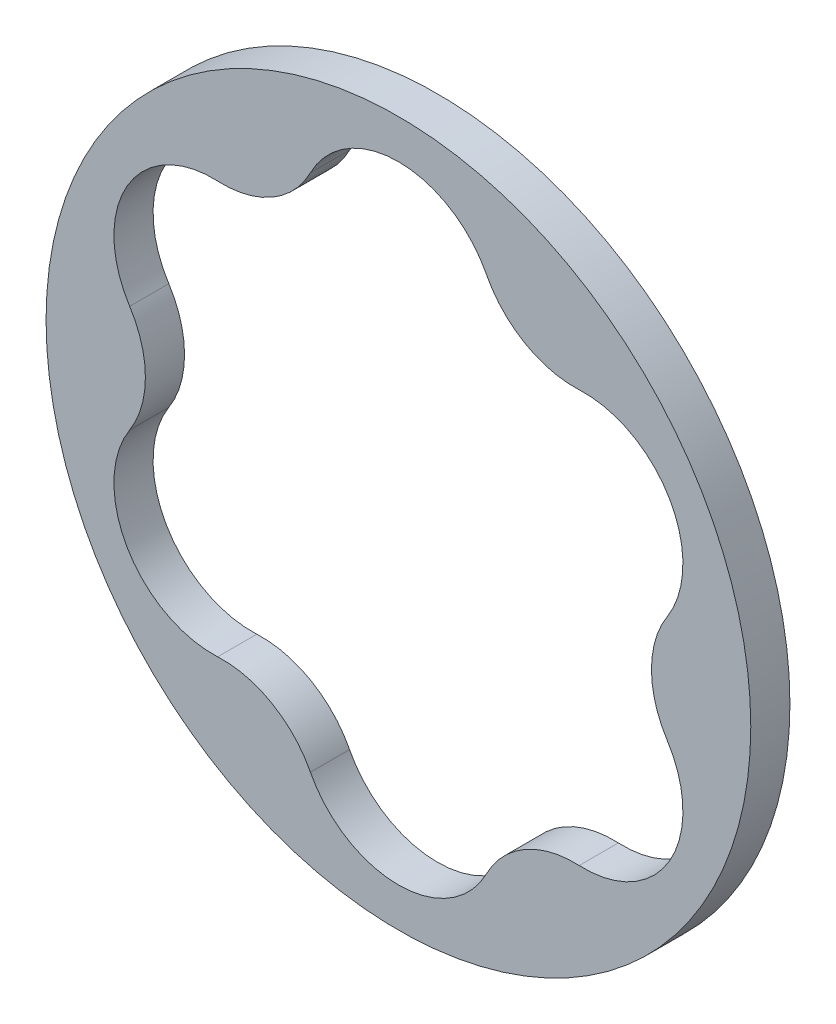
ISO-10303-21;
HEADER;
FILE_DESCRIPTION(('STEP AP214'),'2;1');
FILE_NAME('part.step','',(''),(''),'','','');
FILE_SCHEMA(('AUTOMOTIVE_DESIGN { 1 0 10303 214 1 1 1 1 }'));
ENDSEC;
DATA;
#1=APPLICATION_CONTEXT('core data for automotive mechanical design processes');
#2=APPLICATION_PROTOCOL_DEFINITION('international standard','automotive_design',2000,#1);
#3=PRODUCT_CONTEXT('',#1,'mechanical');
#4=PRODUCT('Part','Part','',(#3));
#5=PRODUCT_RELATED_PRODUCT_CATEGORY('part','',(#4));
#6=PRODUCT_DEFINITION_FORMATION('','',#4);
#7=PRODUCT_DEFINITION_CONTEXT('part definition',#1,'design');
#8=PRODUCT_DEFINITION('design','',#6,#7);
#9=PRODUCT_DEFINITION_SHAPE('','',#8);
#10=(LENGTH_UNIT() NAMED_UNIT(*) SI_UNIT(.MILLI.,.METRE.));
#11=(NAMED_UNIT(*) PLANE_ANGLE_UNIT() SI_UNIT($,.RADIAN.));
#12=(NAMED_UNIT(*) SI_UNIT($,.STERADIAN.) SOLID_ANGLE_UNIT());
#13=UNCERTAINTY_MEASURE_WITH_UNIT(LENGTH_MEASURE(1.E-05),#10,'distance_accuracy_value','');
#14=(GEOMETRIC_REPRESENTATION_CONTEXT(3) GLOBAL_UNCERTAINTY_ASSIGNED_CONTEXT((#13)) GLOBAL_UNIT_ASSIGNED_CONTEXT((#10,
#11,#12)) REPRESENTATION_CONTEXT('',''));
#15=CARTESIAN_POINT('',(0.,0.,0.));
#16=DIRECTION('',(0.,0.,1.));
#17=DIRECTION('',(1.,0.,0.));
#18=AXIS2_PLACEMENT_3D('',#15,#16,#17);
#19=CARTESIAN_POINT('',(0.,0.,0.79375));
#20=DIRECTION('',(0.,0.,1.));
#21=DIRECTION('',(1.,0.,0.));
#22=AXIS2_PLACEMENT_3D('',#19,#20,#21);
#23=PLANE('',#22);
#24=CARTESIAN_POINT('',(0.,0.,0.79375));
#25=DIRECTION('',(0.,0.,1.));
#26=DIRECTION('',(1.,0.,0.));
#27=AXIS2_PLACEMENT_3D('',#24,#25,#26);
#28=CIRCLE('',#27,14.2875);
#29=CARTESIAN_POINT('',(14.2875,0.,0.79375));
#30=VERTEX_POINT('',#29);
#31=EDGE_CURVE('E11',#30,#30,#28,.T.);
#32=ORIENTED_EDGE('',*,*,#31,.T.);
#33=EDGE_LOOP('',(#32));
#34=FACE_BOUND('',#33,.T.);
#35=CARTESIAN_POINT('',(7.52217892727267,4.3429320285534,0.79375));
#36=DIRECTION('',(0.,0.,-1.));
#37=DIRECTION('',(-1.,0.,0.));
#38=AXIS2_PLACEMENT_3D('',#35,#36,#37);
#39=CIRCLE('',#38,4.0141359428932);
#40=CARTESIAN_POINT('',(7.32968208553851,8.35244974692671,0.79375));
#41=VERTEX_POINT('',#40);
#42=CARTESIAN_POINT('',(10.8982747074407,2.1714660142767,0.79375));
#43=VERTEX_POINT('',#42);
#44=EDGE_CURVE('E129',#41,#43,#39,.T.);
#45=ORIENTED_EDGE('',*,*,#44,.T.);
#46=CARTESIAN_POINT('',(14.2743704876087,0.,0.79375));
#47=DIRECTION('',(0.,0.,1.));
#48=DIRECTION('',(-1.,0.,0.));
#49=AXIS2_PLACEMENT_3D('',#46,#47,#48);
#50=CIRCLE('',#49,4.0141359428932);
#51=CARTESIAN_POINT('',(10.8982747074407,-2.1714660142767,0.79375));
#52=VERTEX_POINT('',#51);
#53=EDGE_CURVE('E138',#43,#52,#50,.T.);
#54=ORIENTED_EDGE('',*,*,#53,.T.);
#55=CARTESIAN_POINT('',(7.52217892727267,-4.34293202855341,0.79375));
#56=DIRECTION('',(0.,0.,-1.));
#57=DIRECTION('',(-1.,0.,0.));
#58=AXIS2_PLACEMENT_3D('',#55,#56,#57);
#59=CIRCLE('',#58,4.0141359428932);
#60=CARTESIAN_POINT('',(7.32968208553852,-8.35244974692671,0.79375));
#61=VERTEX_POINT('',#60);
#62=EDGE_CURVE('E53',#52,#61,#59,.T.);
#63=ORIENTED_EDGE('',*,*,#62,.T.);
#64=CARTESIAN_POINT('',(7.13718524380436,-12.3619674653,0.79375));
#65=DIRECTION('',(0.,0.,1.));
#66=DIRECTION('',(-1.,0.,0.));
#67=AXIS2_PLACEMENT_3D('',#64,#65,#66);
#68=CIRCLE('',#67,4.0141359428932);
#69=CARTESIAN_POINT('',(3.56859262190219,-10.5239157612034,0.79375));
#70=VERTEX_POINT('',#69);
#71=EDGE_CURVE('E151',#61,#70,#68,.T.);
#72=ORIENTED_EDGE('',*,*,#71,.T.);
#73=CARTESIAN_POINT('',(0.,-8.6858640571068,0.79375));
#74=DIRECTION('',(0.,0.,-1.));
#75=DIRECTION('',(-1.,0.,0.));
#76=AXIS2_PLACEMENT_3D('',#73,#74,#75);
#77=CIRCLE('',#76,4.0141359428932);
#78=CARTESIAN_POINT('',(-3.56859262190217,-10.5239157612034,0.79375));
#79=VERTEX_POINT('',#78);
#80=EDGE_CURVE('E154',#70,#79,#77,.T.);
#81=ORIENTED_EDGE('',*,*,#80,.T.);
#82=CARTESIAN_POINT('',(-7.13718524380435,-12.3619674653,0.79375));
#83=DIRECTION('',(0.,0.,1.));
#84=DIRECTION('',(-1.,0.,0.));
#85=AXIS2_PLACEMENT_3D('',#82,#83,#84);
#86=CIRCLE('',#85,4.0141359428932);
#87=CARTESIAN_POINT('',(-7.3296820855385,-8.3524497469267,0.79375));
#88=VERTEX_POINT('',#87);
#89=EDGE_CURVE('E157',#79,#88,#86,.T.);
#90=ORIENTED_EDGE('',*,*,#89,.T.);
#91=CARTESIAN_POINT('',(-7.52217892727265,-4.3429320285534,0.79375));
#92=DIRECTION('',(0.,0.,-1.));
#93=DIRECTION('',(-1.,0.,0.));
#94=AXIS2_PLACEMENT_3D('',#91,#92,#93);
#95=CIRCLE('',#94,4.0141359428932);
#96=CARTESIAN_POINT('',(-10.8982747074407,-2.1714660142767,0.79375));
#97=VERTEX_POINT('',#96);
#98=EDGE_CURVE('E160',#88,#97,#95,.T.);
#99=ORIENTED_EDGE('',*,*,#98,.T.);
#100=CARTESIAN_POINT('',(-14.2743704876087,0.,0.79375));
#101=DIRECTION('',(0.,0.,1.));
#102=DIRECTION('',(-1.,0.,0.));
#103=AXIS2_PLACEMENT_3D('',#100,#101,#102);
#104=CIRCLE('',#103,4.0141359428932);
#105=CARTESIAN_POINT('',(-10.8982747074407,2.1714660142767,0.79375));
#106=VERTEX_POINT('',#105);
#107=EDGE_CURVE('E163',#97,#106,#104,.T.);
#108=ORIENTED_EDGE('',*,*,#107,.T.);
#109=CARTESIAN_POINT('',(-7.52217892727264,4.34293202855339,0.79375));
#110=DIRECTION('',(0.,0.,-1.));
#111=DIRECTION('',(-1.,0.,0.));
#112=AXIS2_PLACEMENT_3D('',#109,#110,#111);
#113=CIRCLE('',#112,4.0141359428932);
#114=CARTESIAN_POINT('',(-7.32968208553849,8.35244974692669,0.79375));
#115=VERTEX_POINT('',#114);
#116=EDGE_CURVE('E166',#106,#115,#113,.T.);
#117=ORIENTED_EDGE('',*,*,#116,.T.);
#118=CARTESIAN_POINT('',(-7.13718524380434,12.3619674653,0.79375));
#119=DIRECTION('',(0.,0.,1.));
#120=DIRECTION('',(-1.,0.,0.));
#121=AXIS2_PLACEMENT_3D('',#118,#119,#120);
#122=CIRCLE('',#121,4.0141359428932);
#123=CARTESIAN_POINT('',(-3.56859262190216,10.5239157612034,0.79375));
#124=VERTEX_POINT('',#123);
#125=EDGE_CURVE('E169',#115,#124,#122,.T.);
#126=ORIENTED_EDGE('',*,*,#125,.T.);
#127=CARTESIAN_POINT('',(0.,8.68586405710679,0.79375));
#128=DIRECTION('',(0.,0.,-1.));
#129=DIRECTION('',(-1.,0.,0.));
#130=AXIS2_PLACEMENT_3D('',#127,#128,#129);
#131=CIRCLE('',#130,4.01413594289319);
#132=CARTESIAN_POINT('',(3.56859262190217,10.5239157612034,0.79375));
#133=VERTEX_POINT('',#132);
#134=EDGE_CURVE('E172',#124,#133,#131,.T.);
#135=ORIENTED_EDGE('',*,*,#134,.T.);
#136=CARTESIAN_POINT('',(7.13718524380434,12.3619674653,0.79375));
#137=DIRECTION('',(0.,0.,1.));
#138=DIRECTION('',(-1.,0.,0.));
#139=AXIS2_PLACEMENT_3D('',#136,#137,#138);
#140=CIRCLE('',#139,4.0141359428932);
#141=EDGE_CURVE('E135',#133,#41,#140,.T.);
#142=ORIENTED_EDGE('',*,*,#141,.T.);
#143=EDGE_LOOP('',(#45,#54,#63,#72,#81,#90,#99,#108,#117,#126,#135,#142));
#144=FACE_BOUND('',#143,.T.);
#145=ADVANCED_FACE('F38',(#34,#144),#23,.T.);
#146=CARTESIAN_POINT('',(0.,0.,-0.79375));
#147=DIRECTION('',(0.,0.,1.));
#148=DIRECTION('',(1.,0.,0.));
#149=AXIS2_PLACEMENT_3D('',#146,#147,#148);
#150=PLANE('',#149);
#151=CARTESIAN_POINT('',(0.,0.,-0.79375));
#152=DIRECTION('',(0.,0.,1.));
#153=DIRECTION('',(1.,0.,0.));
#154=AXIS2_PLACEMENT_3D('',#151,#152,#153);
#155=CIRCLE('',#154,14.2875);
#156=CARTESIAN_POINT('',(14.2875,0.,-0.79375));
#157=VERTEX_POINT('',#156);
#158=EDGE_CURVE('E42',#157,#157,#155,.T.);
#159=ORIENTED_EDGE('',*,*,#158,.F.);
#160=EDGE_LOOP('',(#159));
#161=FACE_BOUND('',#160,.T.);
#162=CARTESIAN_POINT('',(14.2743704876087,0.,-0.79375));
#163=DIRECTION('',(0.,0.,1.));
#164=DIRECTION('',(-1.,0.,0.));
#165=AXIS2_PLACEMENT_3D('',#162,#163,#164);
#166=CIRCLE('',#165,4.0141359428932);
#167=CARTESIAN_POINT('',(10.8982747074407,2.1714660142767,-0.79375));
#168=VERTEX_POINT('',#167);
#169=CARTESIAN_POINT('',(10.8982747074407,-2.17146601427671,-0.79375));
#170=VERTEX_POINT('',#169);
#171=EDGE_CURVE('E176',#168,#170,#166,.T.);
#172=ORIENTED_EDGE('',*,*,#171,.F.);
#173=CARTESIAN_POINT('',(7.52217892727267,4.3429320285534,-0.79375));
#174=DIRECTION('',(0.,0.,-1.));
#175=DIRECTION('',(-1.,0.,0.));
#176=AXIS2_PLACEMENT_3D('',#173,#174,#175);
#177=CIRCLE('',#176,4.0141359428932);
#178=CARTESIAN_POINT('',(7.32968208553851,8.35244974692671,-0.79375));
#179=VERTEX_POINT('',#178);
#180=EDGE_CURVE('E61',#179,#168,#177,.T.);
#181=ORIENTED_EDGE('',*,*,#180,.F.);
#182=CARTESIAN_POINT('',(7.13718524380434,12.3619674653,-0.79375));
#183=DIRECTION('',(0.,0.,1.));
#184=DIRECTION('',(-1.,0.,0.));
#185=AXIS2_PLACEMENT_3D('',#182,#183,#184);
#186=CIRCLE('',#185,4.0141359428932);
#187=CARTESIAN_POINT('',(3.56859262190217,10.5239157612034,-0.79375));
#188=VERTEX_POINT('',#187);
#189=EDGE_CURVE('E144',#188,#179,#186,.T.);
#190=ORIENTED_EDGE('',*,*,#189,.F.);
#191=CARTESIAN_POINT('',(0.,8.68586405710679,-0.79375));
#192=DIRECTION('',(0.,0.,-1.));
#193=DIRECTION('',(-1.,0.,0.));
#194=AXIS2_PLACEMENT_3D('',#191,#192,#193);
#195=CIRCLE('',#194,4.01413594289319);
#196=CARTESIAN_POINT('',(-3.56859262190216,10.5239157612034,-0.79375));
#197=VERTEX_POINT('',#196);
#198=EDGE_CURVE('E147',#197,#188,#195,.T.);
#199=ORIENTED_EDGE('',*,*,#198,.F.);
#200=CARTESIAN_POINT('',(-7.13718524380434,12.3619674653,-0.79375));
#201=DIRECTION('',(0.,0.,1.));
#202=DIRECTION('',(-1.,0.,0.));
#203=AXIS2_PLACEMENT_3D('',#200,#201,#202);
#204=CIRCLE('',#203,4.0141359428932);
#205=CARTESIAN_POINT('',(-7.32968208553849,8.35244974692669,-0.79375));
#206=VERTEX_POINT('',#205);
#207=EDGE_CURVE('E199',#206,#197,#204,.T.);
#208=ORIENTED_EDGE('',*,*,#207,.F.);
#209=CARTESIAN_POINT('',(-7.52217892727264,4.34293202855339,-0.79375));
#210=DIRECTION('',(0.,0.,-1.));
#211=DIRECTION('',(-1.,0.,0.));
#212=AXIS2_PLACEMENT_3D('',#209,#210,#211);
#213=CIRCLE('',#212,4.0141359428932);
#214=CARTESIAN_POINT('',(-10.8982747074407,2.1714660142767,-0.79375));
#215=VERTEX_POINT('',#214);
#216=EDGE_CURVE('E196',#215,#206,#213,.T.);
#217=ORIENTED_EDGE('',*,*,#216,.F.);
#218=CARTESIAN_POINT('',(-14.2743704876087,0.,-0.79375));
#219=DIRECTION('',(0.,0.,1.));
#220=DIRECTION('',(-1.,0.,0.));
#221=AXIS2_PLACEMENT_3D('',#218,#219,#220);
#222=CIRCLE('',#221,4.0141359428932);
#223=CARTESIAN_POINT('',(-10.8982747074407,-2.1714660142767,-0.79375));
#224=VERTEX_POINT('',#223);
#225=EDGE_CURVE('E193',#224,#215,#222,.T.);
#226=ORIENTED_EDGE('',*,*,#225,.F.);
#227=CARTESIAN_POINT('',(-7.52217892727265,-4.3429320285534,-0.79375));
#228=DIRECTION('',(0.,0.,-1.));
#229=DIRECTION('',(-1.,0.,0.));
#230=AXIS2_PLACEMENT_3D('',#227,#228,#229);
#231=CIRCLE('',#230,4.0141359428932);
#232=CARTESIAN_POINT('',(-7.3296820855385,-8.3524497469267,-0.79375));
#233=VERTEX_POINT('',#232);
#234=EDGE_CURVE('E190',#233,#224,#231,.T.);
#235=ORIENTED_EDGE('',*,*,#234,.F.);
#236=CARTESIAN_POINT('',(-7.13718524380435,-12.3619674653,-0.79375));
#237=DIRECTION('',(0.,0.,1.));
#238=DIRECTION('',(-1.,0.,0.));
#239=AXIS2_PLACEMENT_3D('',#236,#237,#238);
#240=CIRCLE('',#239,4.0141359428932);
#241=CARTESIAN_POINT('',(-3.56859262190217,-10.5239157612034,-0.79375));
#242=VERTEX_POINT('',#241);
#243=EDGE_CURVE('E187',#242,#233,#240,.T.);
#244=ORIENTED_EDGE('',*,*,#243,.F.);
#245=CARTESIAN_POINT('',(0.,-8.6858640571068,-0.79375));
#246=DIRECTION('',(0.,0.,-1.));
#247=DIRECTION('',(-1.,0.,0.));
#248=AXIS2_PLACEMENT_3D('',#245,#246,#247);
#249=CIRCLE('',#248,4.0141359428932);
#250=CARTESIAN_POINT('',(3.56859262190219,-10.5239157612034,-0.79375));
#251=VERTEX_POINT('',#250);
#252=EDGE_CURVE('E184',#251,#242,#249,.T.);
#253=ORIENTED_EDGE('',*,*,#252,.F.);
#254=CARTESIAN_POINT('',(7.13718524380436,-12.3619674653,-0.79375));
#255=DIRECTION('',(0.,0.,1.));
#256=DIRECTION('',(-1.,0.,0.));
#257=AXIS2_PLACEMENT_3D('',#254,#255,#256);
#258=CIRCLE('',#257,4.0141359428932);
#259=CARTESIAN_POINT('',(7.32968208553852,-8.35244974692671,-0.79375));
#260=VERTEX_POINT('',#259);
#261=EDGE_CURVE('E181',#260,#251,#258,.T.);
#262=ORIENTED_EDGE('',*,*,#261,.F.);
#263=CARTESIAN_POINT('',(7.52217892727267,-4.34293202855341,-0.79375));
#264=DIRECTION('',(0.,0.,-1.));
#265=DIRECTION('',(-1.,0.,0.));
#266=AXIS2_PLACEMENT_3D('',#263,#264,#265);
#267=CIRCLE('',#266,4.0141359428932);
#268=EDGE_CURVE('E178',#170,#260,#267,.T.);
#269=ORIENTED_EDGE('',*,*,#268,.F.);
#270=EDGE_LOOP('',(#172,#181,#190,#199,#208,#217,#226,#235,#244,#253,#262,#269));
#271=FACE_BOUND('',#270,.T.);
#272=ADVANCED_FACE('F228',(#161,#271),#150,.F.);
#273=CARTESIAN_POINT('',(0.,0.,0.79375));
#274=DIRECTION('',(0.,0.,-1.));
#275=DIRECTION('',(-1.,0.,0.));
#276=AXIS2_PLACEMENT_3D('',#273,#274,#275);
#277=CYLINDRICAL_SURFACE('',#276,14.2875);
#278=ORIENTED_EDGE('',*,*,#31,.F.);
#279=EDGE_LOOP('',(#278));
#280=FACE_BOUND('',#279,.T.);
#281=ORIENTED_EDGE('',*,*,#158,.T.);
#282=EDGE_LOOP('',(#281));
#283=FACE_BOUND('',#282,.T.);
#284=ADVANCED_FACE('F40',(#280,#283),#277,.T.);
#285=CARTESIAN_POINT('',(7.52217892727267,4.3429320285534,0.79375));
#286=DIRECTION('',(0.,0.,-1.));
#287=DIRECTION('',(-1.,0.,0.));
#288=AXIS2_PLACEMENT_3D('',#285,#286,#287);
#289=CYLINDRICAL_SURFACE('',#288,4.0141359428932);
#290=ORIENTED_EDGE('',*,*,#180,.T.);
#291=DIRECTION('',(0.,0.,-1.));
#292=VECTOR('',#291,1.);
#293=CARTESIAN_POINT('',(10.8982747074407,2.1714660142767,0.79375));
#294=LINE('',#293,#292);
#295=EDGE_CURVE('E125',#43,#168,#294,.T.);
#296=ORIENTED_EDGE('',*,*,#295,.F.);
#297=ORIENTED_EDGE('',*,*,#44,.F.);
#298=DIRECTION('',(0.,0.,-1.));
#299=VECTOR('',#298,1.);
#300=CARTESIAN_POINT('',(7.32968208553851,8.35244974692671,0.79375));
#301=LINE('',#300,#299);
#302=EDGE_CURVE('E204',#41,#179,#301,.T.);
#303=ORIENTED_EDGE('',*,*,#302,.T.);
#304=EDGE_LOOP('',(#290,#296,#297,#303));
#305=FACE_BOUND('',#304,.T.);
#306=ADVANCED_FACE('F127',(#305),#289,.F.);
#307=CARTESIAN_POINT('',(7.13718524380434,12.3619674653,0.79375));
#308=DIRECTION('',(0.,0.,-1.));
#309=DIRECTION('',(-1.,0.,0.));
#310=AXIS2_PLACEMENT_3D('',#307,#308,#309);
#311=CYLINDRICAL_SURFACE('',#310,4.0141359428932);
#312=ORIENTED_EDGE('',*,*,#189,.T.);
#313=ORIENTED_EDGE('',*,*,#302,.F.);
#314=ORIENTED_EDGE('',*,*,#141,.F.);
#315=DIRECTION('',(0.,0.,-1.));
#316=VECTOR('',#315,1.);
#317=CARTESIAN_POINT('',(3.56859262190217,10.5239157612034,0.79375));
#318=LINE('',#317,#316);
#319=EDGE_CURVE('E206',#133,#188,#318,.T.);
#320=ORIENTED_EDGE('',*,*,#319,.T.);
#321=EDGE_LOOP('',(#312,#313,#314,#320));
#322=FACE_BOUND('',#321,.T.);
#323=ADVANCED_FACE('F262',(#322),#311,.T.);
#324=CARTESIAN_POINT('',(0.,8.68586405710679,0.79375));
#325=DIRECTION('',(0.,0.,-1.));
#326=DIRECTION('',(-1.,0.,0.));
#327=AXIS2_PLACEMENT_3D('',#324,#325,#326);
#328=CYLINDRICAL_SURFACE('',#327,4.01413594289319);
#329=ORIENTED_EDGE('',*,*,#198,.T.);
#330=ORIENTED_EDGE('',*,*,#319,.F.);
#331=ORIENTED_EDGE('',*,*,#134,.F.);
#332=DIRECTION('',(0.,0.,-1.));
#333=VECTOR('',#332,1.);
#334=CARTESIAN_POINT('',(-3.56859262190216,10.5239157612034,0.79375));
#335=LINE('',#334,#333);
#336=EDGE_CURVE('E208',#124,#197,#335,.T.);
#337=ORIENTED_EDGE('',*,*,#336,.T.);
#338=EDGE_LOOP('',(#329,#330,#331,#337));
#339=FACE_BOUND('',#338,.T.);
#340=ADVANCED_FACE('F258',(#339),#328,.F.);
#341=CARTESIAN_POINT('',(-7.13718524380434,12.3619674653,0.79375));
#342=DIRECTION('',(0.,0.,-1.));
#343=DIRECTION('',(-1.,0.,0.));
#344=AXIS2_PLACEMENT_3D('',#341,#342,#343);
#345=CYLINDRICAL_SURFACE('',#344,4.0141359428932);
#346=ORIENTED_EDGE('',*,*,#207,.T.);
#347=ORIENTED_EDGE('',*,*,#336,.F.);
#348=ORIENTED_EDGE('',*,*,#125,.F.);
#349=DIRECTION('',(0.,0.,-1.));
#350=VECTOR('',#349,1.);
#351=CARTESIAN_POINT('',(-7.32968208553849,8.35244974692669,0.79375));
#352=LINE('',#351,#350);
#353=EDGE_CURVE('E210',#115,#206,#352,.T.);
#354=ORIENTED_EDGE('',*,*,#353,.T.);
#355=EDGE_LOOP('',(#346,#347,#348,#354));
#356=FACE_BOUND('',#355,.T.);
#357=ADVANCED_FACE('F255',(#356),#345,.T.);
#358=CARTESIAN_POINT('',(-7.52217892727264,4.34293202855339,0.79375));
#359=DIRECTION('',(0.,0.,-1.));
#360=DIRECTION('',(-1.,0.,0.));
#361=AXIS2_PLACEMENT_3D('',#358,#359,#360);
#362=CYLINDRICAL_SURFACE('',#361,4.0141359428932);
#363=ORIENTED_EDGE('',*,*,#216,.T.);
#364=ORIENTED_EDGE('',*,*,#353,.F.);
#365=ORIENTED_EDGE('',*,*,#116,.F.);
#366=DIRECTION('',(0.,0.,-1.));
#367=VECTOR('',#366,1.);
#368=CARTESIAN_POINT('',(-10.8982747074407,2.1714660142767,0.79375));
#369=LINE('',#368,#367);
#370=EDGE_CURVE('E212',#106,#215,#369,.T.);
#371=ORIENTED_EDGE('',*,*,#370,.T.);
#372=EDGE_LOOP('',(#363,#364,#365,#371));
#373=FACE_BOUND('',#372,.T.);
#374=ADVANCED_FACE('F251',(#373),#362,.F.);
#375=CARTESIAN_POINT('',(-14.2743704876087,0.,0.79375));
#376=DIRECTION('',(0.,0.,-1.));
#377=DIRECTION('',(-1.,0.,0.));
#378=AXIS2_PLACEMENT_3D('',#375,#376,#377);
#379=CYLINDRICAL_SURFACE('',#378,4.0141359428932);
#380=ORIENTED_EDGE('',*,*,#225,.T.);
#381=ORIENTED_EDGE('',*,*,#370,.F.);
#382=ORIENTED_EDGE('',*,*,#107,.F.);
#383=DIRECTION('',(0.,0.,-1.));
#384=VECTOR('',#383,1.);
#385=CARTESIAN_POINT('',(-10.8982747074407,-2.1714660142767,0.79375));
#386=LINE('',#385,#384);
#387=EDGE_CURVE('E214',#97,#224,#386,.T.);
#388=ORIENTED_EDGE('',*,*,#387,.T.);
#389=EDGE_LOOP('',(#380,#381,#382,#388));
#390=FACE_BOUND('',#389,.T.);
#391=ADVANCED_FACE('F247',(#390),#379,.T.);
#392=CARTESIAN_POINT('',(-7.52217892727265,-4.3429320285534,0.79375));
#393=DIRECTION('',(0.,0.,-1.));
#394=DIRECTION('',(-1.,0.,0.));
#395=AXIS2_PLACEMENT_3D('',#392,#393,#394);
#396=CYLINDRICAL_SURFACE('',#395,4.0141359428932);
#397=ORIENTED_EDGE('',*,*,#234,.T.);
#398=ORIENTED_EDGE('',*,*,#387,.F.);
#399=ORIENTED_EDGE('',*,*,#98,.F.);
#400=DIRECTION('',(0.,0.,-1.));
#401=VECTOR('',#400,1.);
#402=CARTESIAN_POINT('',(-7.3296820855385,-8.3524497469267,0.79375));
#403=LINE('',#402,#401);
#404=EDGE_CURVE('E216',#88,#233,#403,.T.);
#405=ORIENTED_EDGE('',*,*,#404,.T.);
#406=EDGE_LOOP('',(#397,#398,#399,#405));
#407=FACE_BOUND('',#406,.T.);
#408=ADVANCED_FACE('F243',(#407),#396,.F.);
#409=CARTESIAN_POINT('',(-7.13718524380435,-12.3619674653,0.79375));
#410=DIRECTION('',(0.,0.,-1.));
#411=DIRECTION('',(-1.,0.,0.));
#412=AXIS2_PLACEMENT_3D('',#409,#410,#411);
#413=CYLINDRICAL_SURFACE('',#412,4.0141359428932);
#414=ORIENTED_EDGE('',*,*,#243,.T.);
#415=ORIENTED_EDGE('',*,*,#404,.F.);
#416=ORIENTED_EDGE('',*,*,#89,.F.);
#417=DIRECTION('',(0.,0.,-1.));
#418=VECTOR('',#417,1.);
#419=CARTESIAN_POINT('',(-3.56859262190217,-10.5239157612034,0.79375));
#420=LINE('',#419,#418);
#421=EDGE_CURVE('E218',#79,#242,#420,.T.);
#422=ORIENTED_EDGE('',*,*,#421,.T.);
#423=EDGE_LOOP('',(#414,#415,#416,#422));
#424=FACE_BOUND('',#423,.T.);
#425=ADVANCED_FACE('F239',(#424),#413,.T.);
#426=CARTESIAN_POINT('',(0.,-8.6858640571068,0.79375));
#427=DIRECTION('',(0.,0.,-1.));
#428=DIRECTION('',(-1.,0.,0.));
#429=AXIS2_PLACEMENT_3D('',#426,#427,#428);
#430=CYLINDRICAL_SURFACE('',#429,4.0141359428932);
#431=ORIENTED_EDGE('',*,*,#252,.T.);
#432=ORIENTED_EDGE('',*,*,#421,.F.);
#433=ORIENTED_EDGE('',*,*,#80,.F.);
#434=DIRECTION('',(0.,0.,-1.));
#435=VECTOR('',#434,1.);
#436=CARTESIAN_POINT('',(3.56859262190219,-10.5239157612034,0.79375));
#437=LINE('',#436,#435);
#438=EDGE_CURVE('E220',#70,#251,#437,.T.);
#439=ORIENTED_EDGE('',*,*,#438,.T.);
#440=EDGE_LOOP('',(#431,#432,#433,#439));
#441=FACE_BOUND('',#440,.T.);
#442=ADVANCED_FACE('F237',(#441),#430,.F.);
#443=CARTESIAN_POINT('',(7.13718524380436,-12.3619674653,0.79375));
#444=DIRECTION('',(0.,0.,-1.));
#445=DIRECTION('',(-1.,0.,0.));
#446=AXIS2_PLACEMENT_3D('',#443,#444,#445);
#447=CYLINDRICAL_SURFACE('',#446,4.0141359428932);
#448=ORIENTED_EDGE('',*,*,#261,.T.);
#449=ORIENTED_EDGE('',*,*,#438,.F.);
#450=ORIENTED_EDGE('',*,*,#71,.F.);
#451=DIRECTION('',(0.,0.,-1.));
#452=VECTOR('',#451,1.);
#453=CARTESIAN_POINT('',(7.32968208553852,-8.35244974692671,0.79375));
#454=LINE('',#453,#452);
#455=EDGE_CURVE('E222',#61,#260,#454,.T.);
#456=ORIENTED_EDGE('',*,*,#455,.T.);
#457=EDGE_LOOP('',(#448,#449,#450,#456));
#458=FACE_BOUND('',#457,.T.);
#459=ADVANCED_FACE('F232',(#458),#447,.T.);
#460=CARTESIAN_POINT('',(7.52217892727267,-4.34293202855341,0.79375));
#461=DIRECTION('',(0.,0.,-1.));
#462=DIRECTION('',(-1.,0.,0.));
#463=AXIS2_PLACEMENT_3D('',#460,#461,#462);
#464=CYLINDRICAL_SURFACE('',#463,4.0141359428932);
#465=ORIENTED_EDGE('',*,*,#268,.T.);
#466=ORIENTED_EDGE('',*,*,#455,.F.);
#467=ORIENTED_EDGE('',*,*,#62,.F.);
#468=DIRECTION('',(0.,0.,-1.));
#469=VECTOR('',#468,1.);
#470=CARTESIAN_POINT('',(10.8982747074407,-2.17146601427671,0.79375));
#471=LINE('',#470,#469);
#472=EDGE_CURVE('E134',#52,#170,#471,.T.);
#473=ORIENTED_EDGE('',*,*,#472,.T.);
#474=EDGE_LOOP('',(#465,#466,#467,#473));
#475=FACE_BOUND('',#474,.T.);
#476=ADVANCED_FACE('F224',(#475),#464,.F.);
#477=CARTESIAN_POINT('',(14.2743704876087,0.,0.79375));
#478=DIRECTION('',(0.,0.,-1.));
#479=DIRECTION('',(-1.,0.,0.));
#480=AXIS2_PLACEMENT_3D('',#477,#478,#479);
#481=CYLINDRICAL_SURFACE('',#480,4.0141359428932);
#482=ORIENTED_EDGE('',*,*,#171,.T.);
#483=ORIENTED_EDGE('',*,*,#472,.F.);
#484=ORIENTED_EDGE('',*,*,#53,.F.);
#485=ORIENTED_EDGE('',*,*,#295,.T.);
#486=EDGE_LOOP('',(#482,#483,#484,#485));
#487=FACE_BOUND('',#486,.T.);
#488=ADVANCED_FACE('F139',(#487),#481,.T.);
#489=CLOSED_SHELL('',(#145,#272,#284,#306,#323,#340,#357,#374,#391,#408,#425,#442,#459,#476,#488));
#490=MANIFOLD_SOLID_BREP('B2',#489);
#491=ADVANCED_BREP_SHAPE_REPRESENTATION('',(#18,#490),#14);
#492=SHAPE_DEFINITION_REPRESENTATION(#9,#491);
ENDSEC;
END-ISO-10303-21;
